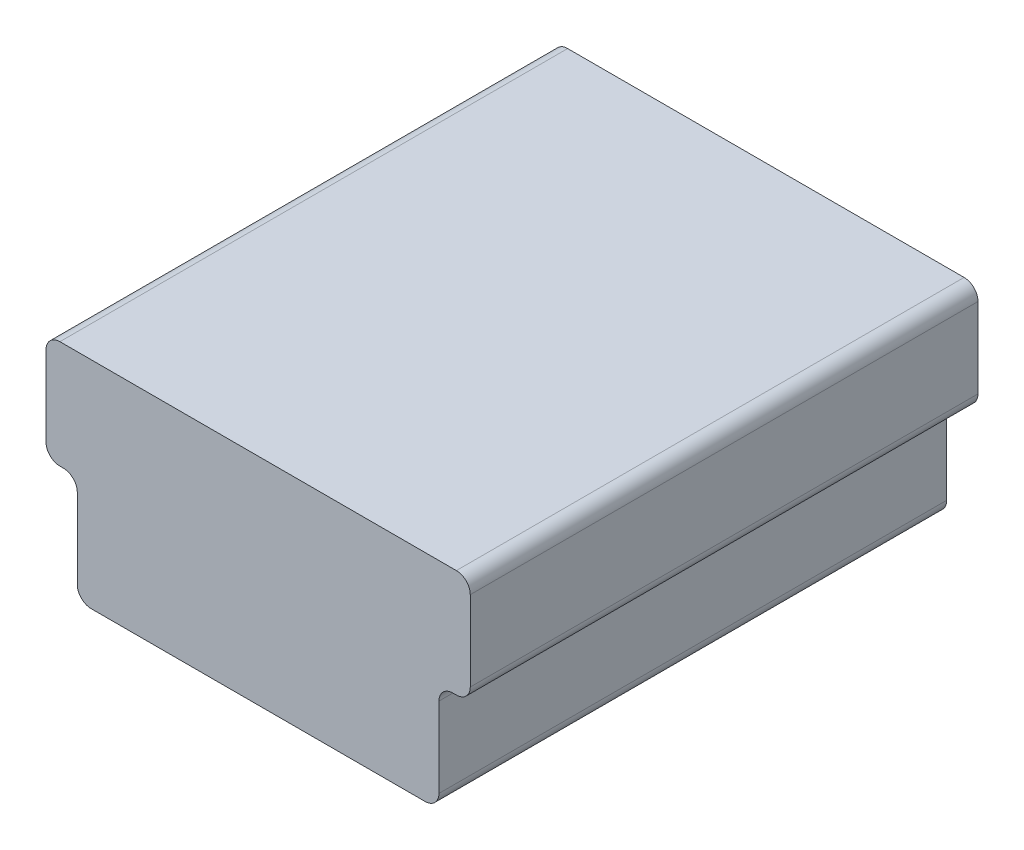
ISO-10303-21;
HEADER;
FILE_DESCRIPTION(('STEP AP214'),'2;1');
FILE_NAME('part.step','',(''),(''),'','','');
FILE_SCHEMA(('AUTOMOTIVE_DESIGN { 1 0 10303 214 1 1 1 1 }'));
ENDSEC;
DATA;
#1=APPLICATION_CONTEXT('core data for automotive mechanical design processes');
#2=APPLICATION_PROTOCOL_DEFINITION('international standard','automotive_design',2000,#1);
#3=PRODUCT_CONTEXT('',#1,'mechanical');
#4=PRODUCT('Part','Part','',(#3));
#5=PRODUCT_RELATED_PRODUCT_CATEGORY('part','',(#4));
#6=PRODUCT_DEFINITION_FORMATION('','',#4);
#7=PRODUCT_DEFINITION_CONTEXT('part definition',#1,'design');
#8=PRODUCT_DEFINITION('design','',#6,#7);
#9=PRODUCT_DEFINITION_SHAPE('','',#8);
#10=(LENGTH_UNIT() NAMED_UNIT(*) SI_UNIT(.MILLI.,.METRE.));
#11=(NAMED_UNIT(*) PLANE_ANGLE_UNIT() SI_UNIT($,.RADIAN.));
#12=(NAMED_UNIT(*) SI_UNIT($,.STERADIAN.) SOLID_ANGLE_UNIT());
#13=UNCERTAINTY_MEASURE_WITH_UNIT(LENGTH_MEASURE(1.E-05),#10,'distance_accuracy_value','');
#14=(GEOMETRIC_REPRESENTATION_CONTEXT(3) GLOBAL_UNCERTAINTY_ASSIGNED_CONTEXT((#13)) GLOBAL_UNIT_ASSIGNED_CONTEXT((#10,
#11,#12)) REPRESENTATION_CONTEXT('',''));
#15=CARTESIAN_POINT('',(0.,0.,0.));
#16=DIRECTION('',(0.,0.,1.));
#17=DIRECTION('',(1.,0.,0.));
#18=AXIS2_PLACEMENT_3D('',#15,#16,#17);
#19=CARTESIAN_POINT('',(3.556,1.9685,0.));
#20=DIRECTION('',(0.,1.,0.));
#21=DIRECTION('',(0.,0.,1.));
#22=AXIS2_PLACEMENT_3D('',#19,#20,#21);
#23=PLANE('',#22);
#24=DIRECTION('',(-1.,0.,0.));
#25=VECTOR('',#24,1.);
#26=CARTESIAN_POINT('',(3.58775,1.9685,0.));
#27=LINE('',#26,#25);
#28=CARTESIAN_POINT('',(3.61950000004886,1.9685,0.));
#29=VERTEX_POINT('',#28);
#30=CARTESIAN_POINT('',(3.55600000002605,1.9685,0.));
#31=VERTEX_POINT('',#30);
#32=EDGE_CURVE('E255',#29,#31,#27,.T.);
#33=ORIENTED_EDGE('',*,*,#32,.F.);
#34=DIRECTION('',(0.,0.,-1.));
#35=VECTOR('',#34,1.);
#36=CARTESIAN_POINT('',(3.61950000009771,1.9685,4.6355));
#37=LINE('',#36,#35);
#38=CARTESIAN_POINT('',(3.61950000004886,1.9685,9.271));
#39=VERTEX_POINT('',#38);
#40=EDGE_CURVE('E266',#29,#39,#37,.F.);
#41=ORIENTED_EDGE('',*,*,#40,.T.);
#42=DIRECTION('',(1.,0.,0.));
#43=VECTOR('',#42,1.);
#44=CARTESIAN_POINT('',(3.58775,1.9685,9.271));
#45=LINE('',#44,#43);
#46=CARTESIAN_POINT('',(3.55600000002605,1.9685,9.271));
#47=VERTEX_POINT('',#46);
#48=EDGE_CURVE('E261',#47,#39,#45,.T.);
#49=ORIENTED_EDGE('',*,*,#48,.F.);
#50=DIRECTION('',(0.,0.,-1.));
#51=VECTOR('',#50,1.);
#52=CARTESIAN_POINT('',(3.5560000000521,1.9685,4.6355));
#53=LINE('',#52,#51);
#54=EDGE_CURVE('E257',#31,#47,#53,.F.);
#55=ORIENTED_EDGE('',*,*,#54,.F.);
#56=EDGE_LOOP('',(#33,#41,#49,#55));
#57=FACE_BOUND('',#56,.T.);
#58=ADVANCED_FACE('F15',(#57),#23,.F.);
#59=CARTESIAN_POINT('',(-3.6195,1.9685,0.));
#60=DIRECTION('',(0.,1.,0.));
#61=DIRECTION('',(0.,0.,1.));
#62=AXIS2_PLACEMENT_3D('',#59,#60,#61);
#63=PLANE('',#62);
#64=DIRECTION('',(-1.,0.,0.));
#65=VECTOR('',#64,1.);
#66=CARTESIAN_POINT('',(-3.58775,1.9685,0.));
#67=LINE('',#66,#65);
#68=CARTESIAN_POINT('',(-3.55599999997395,1.9685,0.));
#69=VERTEX_POINT('',#68);
#70=CARTESIAN_POINT('',(-3.61949999995115,1.9685,0.));
#71=VERTEX_POINT('',#70);
#72=EDGE_CURVE('E220',#69,#71,#67,.T.);
#73=ORIENTED_EDGE('',*,*,#72,.F.);
#74=DIRECTION('',(0.,0.,1.));
#75=VECTOR('',#74,1.);
#76=CARTESIAN_POINT('',(-3.5559999999479,1.9685,4.6355));
#77=LINE('',#76,#75);
#78=CARTESIAN_POINT('',(-3.55599999997395,1.9685,9.271));
#79=VERTEX_POINT('',#78);
#80=EDGE_CURVE('E249',#79,#69,#77,.F.);
#81=ORIENTED_EDGE('',*,*,#80,.F.);
#82=DIRECTION('',(1.,0.,0.));
#83=VECTOR('',#82,1.);
#84=CARTESIAN_POINT('',(-3.58775,1.9685,9.271));
#85=LINE('',#84,#83);
#86=CARTESIAN_POINT('',(-3.61949999995115,1.9685,9.271));
#87=VERTEX_POINT('',#86);
#88=EDGE_CURVE('E253',#87,#79,#85,.T.);
#89=ORIENTED_EDGE('',*,*,#88,.F.);
#90=DIRECTION('',(0.,0.,1.));
#91=VECTOR('',#90,1.);
#92=CARTESIAN_POINT('',(-3.61949999990229,1.9685,4.6355));
#93=LINE('',#92,#91);
#94=EDGE_CURVE('E217',#87,#71,#93,.F.);
#95=ORIENTED_EDGE('',*,*,#94,.T.);
#96=EDGE_LOOP('',(#73,#81,#89,#95));
#97=FACE_BOUND('',#96,.T.);
#98=ADVANCED_FACE('F349',(#97),#63,.F.);
#99=CARTESIAN_POINT('',(-3.6195,2.2225,9.271));
#100=DIRECTION('',(0.,0.,-1.));
#101=DIRECTION('',(-1.,0.,0.));
#102=AXIS2_PLACEMENT_3D('',#99,#100,#101);
#103=CYLINDRICAL_SURFACE('',#102,0.254);
#104=CARTESIAN_POINT('',(-3.6195,2.2225,0.));
#105=DIRECTION('',(0.,0.,-1.));
#106=DIRECTION('',(-1.,0.,0.));
#107=AXIS2_PLACEMENT_3D('',#104,#105,#106);
#108=CIRCLE('',#107,0.254);
#109=CARTESIAN_POINT('',(-3.8735,2.2225,0.));
#110=VERTEX_POINT('',#109);
#111=EDGE_CURVE('E271',#71,#110,#108,.T.);
#112=ORIENTED_EDGE('',*,*,#111,.F.);
#113=ORIENTED_EDGE('',*,*,#94,.F.);
#114=CARTESIAN_POINT('',(-3.6195,2.2225,9.271));
#115=DIRECTION('',(0.,0.,-1.));
#116=DIRECTION('',(-1.,0.,0.));
#117=AXIS2_PLACEMENT_3D('',#114,#115,#116);
#118=CIRCLE('',#117,0.254);
#119=CARTESIAN_POINT('',(-3.8735,2.2225,9.271));
#120=VERTEX_POINT('',#119);
#121=EDGE_CURVE('E19',#120,#87,#118,.F.);
#122=ORIENTED_EDGE('',*,*,#121,.F.);
#123=DIRECTION('',(0.,0.,-1.));
#124=VECTOR('',#123,1.);
#125=CARTESIAN_POINT('',(-3.8735,2.2225,4.6355));
#126=LINE('',#125,#124);
#127=EDGE_CURVE('E215',#120,#110,#126,.T.);
#128=ORIENTED_EDGE('',*,*,#127,.T.);
#129=EDGE_LOOP('',(#112,#113,#122,#128));
#130=FACE_BOUND('',#129,.T.);
#131=ADVANCED_FACE('F214',(#130),#103,.T.);
#132=CARTESIAN_POINT('',(3.6195,2.2225,9.271));
#133=DIRECTION('',(0.,0.,-1.));
#134=DIRECTION('',(-1.,0.,0.));
#135=AXIS2_PLACEMENT_3D('',#132,#133,#134);
#136=CYLINDRICAL_SURFACE('',#135,0.254);
#137=CARTESIAN_POINT('',(3.6195,2.2225,0.));
#138=DIRECTION('',(0.,0.,-1.));
#139=DIRECTION('',(-1.,0.,0.));
#140=AXIS2_PLACEMENT_3D('',#137,#138,#139);
#141=CIRCLE('',#140,0.254);
#142=CARTESIAN_POINT('',(3.8735,2.2225,0.));
#143=VERTEX_POINT('',#142);
#144=EDGE_CURVE('E269',#143,#29,#141,.T.);
#145=ORIENTED_EDGE('',*,*,#144,.F.);
#146=DIRECTION('',(0.,0.,1.));
#147=VECTOR('',#146,1.);
#148=CARTESIAN_POINT('',(3.8735,2.2225,4.6355));
#149=LINE('',#148,#147);
#150=CARTESIAN_POINT('',(3.8735,2.2225,9.271));
#151=VERTEX_POINT('',#150);
#152=EDGE_CURVE('E245',#143,#151,#149,.T.);
#153=ORIENTED_EDGE('',*,*,#152,.T.);
#154=CARTESIAN_POINT('',(3.6195,2.2225,9.271));
#155=DIRECTION('',(0.,0.,-1.));
#156=DIRECTION('',(-1.,0.,0.));
#157=AXIS2_PLACEMENT_3D('',#154,#155,#156);
#158=CIRCLE('',#157,0.254);
#159=EDGE_CURVE('E340',#39,#151,#158,.F.);
#160=ORIENTED_EDGE('',*,*,#159,.F.);
#161=ORIENTED_EDGE('',*,*,#40,.F.);
#162=EDGE_LOOP('',(#145,#153,#160,#161));
#163=FACE_BOUND('',#162,.T.);
#164=ADVANCED_FACE('F799',(#163),#136,.T.);
#165=CARTESIAN_POINT('',(3.556,1.7145,9.271));
#166=DIRECTION('',(0.,0.,-1.));
#167=DIRECTION('',(-1.,0.,0.));
#168=AXIS2_PLACEMENT_3D('',#165,#166,#167);
#169=CYLINDRICAL_SURFACE('',#168,0.254);
#170=ORIENTED_EDGE('',*,*,#54,.T.);
#171=CARTESIAN_POINT('',(3.556,1.7145,9.271));
#172=DIRECTION('',(0.,0.,-1.));
#173=DIRECTION('',(-1.,0.,0.));
#174=AXIS2_PLACEMENT_3D('',#171,#172,#173);
#175=CIRCLE('',#174,0.254);
#176=CARTESIAN_POINT('',(3.301999999238,1.7145,9.271));
#177=VERTEX_POINT('',#176);
#178=EDGE_CURVE('E252',#47,#177,#175,.F.);
#179=ORIENTED_EDGE('',*,*,#178,.T.);
#180=DIRECTION('',(0.,0.,-1.));
#181=VECTOR('',#180,1.);
#182=CARTESIAN_POINT('',(3.302,1.7145,4.6355));
#183=LINE('',#182,#181);
#184=CARTESIAN_POINT('',(3.302,1.7145,0.));
#185=VERTEX_POINT('',#184);
#186=EDGE_CURVE('E247',#177,#185,#183,.T.);
#187=ORIENTED_EDGE('',*,*,#186,.T.);
#188=CARTESIAN_POINT('',(3.556,1.7145,0.));
#189=DIRECTION('',(0.,0.,-1.));
#190=DIRECTION('',(-1.,0.,0.));
#191=AXIS2_PLACEMENT_3D('',#188,#189,#190);
#192=CIRCLE('',#191,0.254);
#193=EDGE_CURVE('E260',#185,#31,#192,.T.);
#194=ORIENTED_EDGE('',*,*,#193,.T.);
#195=EDGE_LOOP('',(#170,#179,#187,#194));
#196=FACE_BOUND('',#195,.T.);
#197=ADVANCED_FACE('F792',(#196),#169,.F.);
#198=CARTESIAN_POINT('',(-3.556,1.7145,9.271));
#199=DIRECTION('',(0.,0.,-1.));
#200=DIRECTION('',(-1.,0.,0.));
#201=AXIS2_PLACEMENT_3D('',#198,#199,#200);
#202=CYLINDRICAL_SURFACE('',#201,0.254);
#203=DIRECTION('',(0.,0.,1.));
#204=VECTOR('',#203,1.);
#205=CARTESIAN_POINT('',(-3.302,1.7145,4.6355));
#206=LINE('',#205,#204);
#207=CARTESIAN_POINT('',(-3.302,1.7145,0.));
#208=VERTEX_POINT('',#207);
#209=CARTESIAN_POINT('',(-3.301999999238,1.7145,9.271));
#210=VERTEX_POINT('',#209);
#211=EDGE_CURVE('E355',#208,#210,#206,.T.);
#212=ORIENTED_EDGE('',*,*,#211,.T.);
#213=CARTESIAN_POINT('',(-3.556,1.7145,9.271));
#214=DIRECTION('',(0.,0.,-1.));
#215=DIRECTION('',(-1.,0.,0.));
#216=AXIS2_PLACEMENT_3D('',#213,#214,#215);
#217=CIRCLE('',#216,0.254);
#218=EDGE_CURVE('E234',#210,#79,#217,.F.);
#219=ORIENTED_EDGE('',*,*,#218,.T.);
#220=ORIENTED_EDGE('',*,*,#80,.T.);
#221=CARTESIAN_POINT('',(-3.556,1.7145,0.));
#222=DIRECTION('',(0.,0.,-1.));
#223=DIRECTION('',(-1.,0.,0.));
#224=AXIS2_PLACEMENT_3D('',#221,#222,#223);
#225=CIRCLE('',#224,0.254);
#226=EDGE_CURVE('E237',#69,#208,#225,.T.);
#227=ORIENTED_EDGE('',*,*,#226,.T.);
#228=EDGE_LOOP('',(#212,#219,#220,#227));
#229=FACE_BOUND('',#228,.T.);
#230=ADVANCED_FACE('F353',(#229),#202,.F.);
#231=CARTESIAN_POINT('',(-3.8735,2.2225,9.271));
#232=DIRECTION('',(1.,0.,0.));
#233=DIRECTION('',(0.,0.,-1.));
#234=AXIS2_PLACEMENT_3D('',#231,#232,#233);
#235=PLANE('',#234);
#236=DIRECTION('',(0.,1.,0.));
#237=VECTOR('',#236,1.);
#238=CARTESIAN_POINT('',(-3.8735,2.95275,0.));
#239=LINE('',#238,#237);
#240=CARTESIAN_POINT('',(-3.8735,3.683,0.));
#241=VERTEX_POINT('',#240);
#242=EDGE_CURVE('E227',#110,#241,#239,.T.);
#243=ORIENTED_EDGE('',*,*,#242,.F.);
#244=ORIENTED_EDGE('',*,*,#127,.F.);
#245=DIRECTION('',(0.,-1.,0.));
#246=VECTOR('',#245,1.);
#247=CARTESIAN_POINT('',(-3.8735,2.95275,9.271));
#248=LINE('',#247,#246);
#249=CARTESIAN_POINT('',(-3.8735,3.683,9.271));
#250=VERTEX_POINT('',#249);
#251=EDGE_CURVE('E225',#250,#120,#248,.T.);
#252=ORIENTED_EDGE('',*,*,#251,.F.);
#253=DIRECTION('',(0.,0.,1.));
#254=VECTOR('',#253,1.);
#255=CARTESIAN_POINT('',(-3.8735,3.683,4.6355));
#256=LINE('',#255,#254);
#257=EDGE_CURVE('E333',#250,#241,#256,.F.);
#258=ORIENTED_EDGE('',*,*,#257,.T.);
#259=EDGE_LOOP('',(#243,#244,#252,#258));
#260=FACE_BOUND('',#259,.T.);
#261=ADVANCED_FACE('F223',(#260),#235,.F.);
#262=CARTESIAN_POINT('',(3.8735,2.2225,0.));
#263=DIRECTION('',(-1.,0.,0.));
#264=DIRECTION('',(0.,0.,1.));
#265=AXIS2_PLACEMENT_3D('',#262,#263,#264);
#266=PLANE('',#265);
#267=DIRECTION('',(0.,-1.,0.));
#268=VECTOR('',#267,1.);
#269=CARTESIAN_POINT('',(3.8735,2.95275,0.));
#270=LINE('',#269,#268);
#271=CARTESIAN_POINT('',(3.8735,3.6829999999479,0.));
#272=VERTEX_POINT('',#271);
#273=EDGE_CURVE('E241',#272,#143,#270,.T.);
#274=ORIENTED_EDGE('',*,*,#273,.F.);
#275=DIRECTION('',(0.,0.,-1.));
#276=VECTOR('',#275,1.);
#277=CARTESIAN_POINT('',(3.8735,3.68299999989581,4.6355));
#278=LINE('',#277,#276);
#279=CARTESIAN_POINT('',(3.8735,3.6829999999479,9.271));
#280=VERTEX_POINT('',#279);
#281=EDGE_CURVE('E331',#272,#280,#278,.F.);
#282=ORIENTED_EDGE('',*,*,#281,.T.);
#283=DIRECTION('',(0.,1.,0.));
#284=VECTOR('',#283,1.);
#285=CARTESIAN_POINT('',(3.8735,2.95275,9.271));
#286=LINE('',#285,#284);
#287=EDGE_CURVE('E244',#151,#280,#286,.T.);
#288=ORIENTED_EDGE('',*,*,#287,.F.);
#289=ORIENTED_EDGE('',*,*,#152,.F.);
#290=EDGE_LOOP('',(#274,#282,#288,#289));
#291=FACE_BOUND('',#290,.T.);
#292=ADVANCED_FACE('F389',(#291),#266,.F.);
#293=CARTESIAN_POINT('',(3.302,1.7145,0.));
#294=DIRECTION('',(-1.,0.,0.));
#295=DIRECTION('',(0.,-1.,0.));
#296=AXIS2_PLACEMENT_3D('',#293,#294,#295);
#297=PLANE('',#296);
#298=DIRECTION('',(0.,-1.,0.));
#299=VECTOR('',#298,1.);
#300=CARTESIAN_POINT('',(3.302,0.98425,0.));
#301=LINE('',#300,#299);
#302=CARTESIAN_POINT('',(3.302,0.253999999947904,0.));
#303=VERTEX_POINT('',#302);
#304=EDGE_CURVE('E376',#185,#303,#301,.T.);
#305=ORIENTED_EDGE('',*,*,#304,.F.);
#306=ORIENTED_EDGE('',*,*,#186,.F.);
#307=DIRECTION('',(0.,1.,0.));
#308=VECTOR('',#307,1.);
#309=CARTESIAN_POINT('',(3.301999998476,1.9685,9.271));
#310=LINE('',#309,#308);
#311=CARTESIAN_POINT('',(3.301999999238,0.253999999947904,9.271));
#312=VERTEX_POINT('',#311);
#313=EDGE_CURVE('E327',#312,#177,#310,.T.);
#314=ORIENTED_EDGE('',*,*,#313,.F.);
#315=DIRECTION('',(0.,0.,1.));
#316=VECTOR('',#315,1.);
#317=CARTESIAN_POINT('',(3.302,0.253999999895808,4.6355));
#318=LINE('',#317,#316);
#319=EDGE_CURVE('E319',#312,#303,#318,.F.);
#320=ORIENTED_EDGE('',*,*,#319,.T.);
#321=EDGE_LOOP('',(#305,#306,#314,#320));
#322=FACE_BOUND('',#321,.T.);
#323=ADVANCED_FACE('F766',(#322),#297,.F.);
#324=CARTESIAN_POINT('',(-3.302,0.254,0.));
#325=DIRECTION('',(1.,0.,0.));
#326=DIRECTION('',(0.,1.,0.));
#327=AXIS2_PLACEMENT_3D('',#324,#325,#326);
#328=PLANE('',#327);
#329=DIRECTION('',(0.,1.,0.));
#330=VECTOR('',#329,1.);
#331=CARTESIAN_POINT('',(-3.302,0.98425,0.));
#332=LINE('',#331,#330);
#333=CARTESIAN_POINT('',(-3.302,0.253999999977193,0.));
#334=VERTEX_POINT('',#333);
#335=EDGE_CURVE('E359',#334,#208,#332,.T.);
#336=ORIENTED_EDGE('',*,*,#335,.F.);
#337=DIRECTION('',(0.,0.,-1.));
#338=VECTOR('',#337,1.);
#339=CARTESIAN_POINT('',(-3.302,0.253999999954385,4.6355));
#340=LINE('',#339,#338);
#341=CARTESIAN_POINT('',(-3.301999999238,0.253999999977193,9.271));
#342=VERTEX_POINT('',#341);
#343=EDGE_CURVE('E311',#334,#342,#340,.F.);
#344=ORIENTED_EDGE('',*,*,#343,.T.);
#345=DIRECTION('',(0.,-1.,0.));
#346=VECTOR('',#345,1.);
#347=CARTESIAN_POINT('',(-3.301999998476,1.9685,9.271));
#348=LINE('',#347,#346);
#349=EDGE_CURVE('E323',#210,#342,#348,.T.);
#350=ORIENTED_EDGE('',*,*,#349,.F.);
#351=ORIENTED_EDGE('',*,*,#211,.F.);
#352=EDGE_LOOP('',(#336,#344,#350,#351));
#353=FACE_BOUND('',#352,.T.);
#354=ADVANCED_FACE('F362',(#353),#328,.F.);
#355=CARTESIAN_POINT('',(-3.6195,3.683,9.271));
#356=DIRECTION('',(0.,0.,-1.));
#357=DIRECTION('',(-1.,0.,0.));
#358=AXIS2_PLACEMENT_3D('',#355,#356,#357);
#359=CYLINDRICAL_SURFACE('',#358,0.254);
#360=CARTESIAN_POINT('',(-3.6195,3.683,0.));
#361=DIRECTION('',(0.,0.,-1.));
#362=DIRECTION('',(-1.,0.,0.));
#363=AXIS2_PLACEMENT_3D('',#360,#361,#362);
#364=CIRCLE('',#363,0.254);
#365=CARTESIAN_POINT('',(-3.6195,3.937,0.));
#366=VERTEX_POINT('',#365);
#367=EDGE_CURVE('E332',#241,#366,#364,.T.);
#368=ORIENTED_EDGE('',*,*,#367,.F.);
#369=ORIENTED_EDGE('',*,*,#257,.F.);
#370=CARTESIAN_POINT('',(-3.6195,3.683,9.271));
#371=DIRECTION('',(0.,0.,-1.));
#372=DIRECTION('',(-1.,0.,0.));
#373=AXIS2_PLACEMENT_3D('',#370,#371,#372);
#374=CIRCLE('',#373,0.254);
#375=CARTESIAN_POINT('',(-3.6195,3.937,9.271));
#376=VERTEX_POINT('',#375);
#377=EDGE_CURVE('E233',#376,#250,#374,.F.);
#378=ORIENTED_EDGE('',*,*,#377,.F.);
#379=DIRECTION('',(0.,0.,-1.));
#380=VECTOR('',#379,1.);
#381=CARTESIAN_POINT('',(-3.6195,3.937,4.6355));
#382=LINE('',#381,#380);
#383=EDGE_CURVE('E373',#376,#366,#382,.T.);
#384=ORIENTED_EDGE('',*,*,#383,.T.);
#385=EDGE_LOOP('',(#368,#369,#378,#384));
#386=FACE_BOUND('',#385,.T.);
#387=ADVANCED_FACE('F754',(#386),#359,.T.);
#388=CARTESIAN_POINT('',(3.6195,3.683,9.271));
#389=DIRECTION('',(0.,0.,-1.));
#390=DIRECTION('',(-1.,0.,0.));
#391=AXIS2_PLACEMENT_3D('',#388,#389,#390);
#392=CYLINDRICAL_SURFACE('',#391,0.254);
#393=CARTESIAN_POINT('',(3.6195,3.683,0.));
#394=DIRECTION('',(0.,0.,-1.));
#395=DIRECTION('',(-1.,0.,0.));
#396=AXIS2_PLACEMENT_3D('',#393,#394,#395);
#397=CIRCLE('',#396,0.254);
#398=CARTESIAN_POINT('',(3.6195,3.937,0.));
#399=VERTEX_POINT('',#398);
#400=EDGE_CURVE('E328',#399,#272,#397,.T.);
#401=ORIENTED_EDGE('',*,*,#400,.F.);
#402=DIRECTION('',(0.,0.,1.));
#403=VECTOR('',#402,1.);
#404=CARTESIAN_POINT('',(3.6195,3.937,4.6355));
#405=LINE('',#404,#403);
#406=CARTESIAN_POINT('',(3.6195,3.937,9.271));
#407=VERTEX_POINT('',#406);
#408=EDGE_CURVE('E395',#399,#407,#405,.T.);
#409=ORIENTED_EDGE('',*,*,#408,.T.);
#410=CARTESIAN_POINT('',(3.6195,3.683,9.271));
#411=DIRECTION('',(0.,0.,-1.));
#412=DIRECTION('',(-1.,0.,0.));
#413=AXIS2_PLACEMENT_3D('',#410,#411,#412);
#414=CIRCLE('',#413,0.254);
#415=EDGE_CURVE('E325',#280,#407,#414,.F.);
#416=ORIENTED_EDGE('',*,*,#415,.F.);
#417=ORIENTED_EDGE('',*,*,#281,.F.);
#418=EDGE_LOOP('',(#401,#409,#416,#417));
#419=FACE_BOUND('',#418,.T.);
#420=ADVANCED_FACE('F392',(#419),#392,.T.);
#421=CARTESIAN_POINT('',(-3.8735,0.,9.271));
#422=DIRECTION('',(0.,0.,1.));
#423=DIRECTION('',(1.,0.,0.));
#424=AXIS2_PLACEMENT_3D('',#421,#422,#423);
#425=PLANE('',#424);
#426=CARTESIAN_POINT('',(-3.048,0.254,9.271));
#427=DIRECTION('',(0.,0.,-1.));
#428=DIRECTION('',(-1.,0.,0.));
#429=AXIS2_PLACEMENT_3D('',#426,#427,#428);
#430=CIRCLE('',#429,0.254);
#431=CARTESIAN_POINT('',(-3.048,0.,9.271));
#432=VERTEX_POINT('',#431);
#433=EDGE_CURVE('E315',#342,#432,#430,.F.);
#434=ORIENTED_EDGE('',*,*,#433,.T.);
#435=DIRECTION('',(1.,0.,0.));
#436=VECTOR('',#435,1.);
#437=CARTESIAN_POINT('',(0.,0.,9.271));
#438=LINE('',#437,#436);
#439=CARTESIAN_POINT('',(3.048,0.,9.271));
#440=VERTEX_POINT('',#439);
#441=EDGE_CURVE('E368',#432,#440,#438,.T.);
#442=ORIENTED_EDGE('',*,*,#441,.T.);
#443=CARTESIAN_POINT('',(3.048,0.254,9.271));
#444=DIRECTION('',(0.,0.,-1.));
#445=DIRECTION('',(-1.,0.,0.));
#446=AXIS2_PLACEMENT_3D('',#443,#444,#445);
#447=CIRCLE('',#446,0.254);
#448=EDGE_CURVE('E320',#440,#312,#447,.F.);
#449=ORIENTED_EDGE('',*,*,#448,.T.);
#450=ORIENTED_EDGE('',*,*,#313,.T.);
#451=ORIENTED_EDGE('',*,*,#178,.F.);
#452=ORIENTED_EDGE('',*,*,#48,.T.);
#453=ORIENTED_EDGE('',*,*,#159,.T.);
#454=ORIENTED_EDGE('',*,*,#287,.T.);
#455=ORIENTED_EDGE('',*,*,#415,.T.);
#456=DIRECTION('',(-1.,0.,0.));
#457=VECTOR('',#456,1.);
#458=CARTESIAN_POINT('',(0.,3.937,9.271));
#459=LINE('',#458,#457);
#460=EDGE_CURVE('E303',#407,#376,#459,.T.);
#461=ORIENTED_EDGE('',*,*,#460,.T.);
#462=ORIENTED_EDGE('',*,*,#377,.T.);
#463=ORIENTED_EDGE('',*,*,#251,.T.);
#464=ORIENTED_EDGE('',*,*,#121,.T.);
#465=ORIENTED_EDGE('',*,*,#88,.T.);
#466=ORIENTED_EDGE('',*,*,#218,.F.);
#467=ORIENTED_EDGE('',*,*,#349,.T.);
#468=EDGE_LOOP('',(#434,#442,#449,#450,#451,#452,#453,#454,#455,#461,#462,#463,#464,#465,#466,#467));
#469=FACE_BOUND('',#468,.T.);
#470=ADVANCED_FACE('F231',(#469),#425,.T.);
#471=CARTESIAN_POINT('',(3.048,0.254,9.271));
#472=DIRECTION('',(0.,0.,-1.));
#473=DIRECTION('',(-1.,0.,0.));
#474=AXIS2_PLACEMENT_3D('',#471,#472,#473);
#475=CYLINDRICAL_SURFACE('',#474,0.254);
#476=CARTESIAN_POINT('',(3.048,0.254,0.));
#477=DIRECTION('',(0.,0.,-1.));
#478=DIRECTION('',(-1.,0.,0.));
#479=AXIS2_PLACEMENT_3D('',#476,#477,#478);
#480=CIRCLE('',#479,0.254);
#481=CARTESIAN_POINT('',(3.048,0.,0.));
#482=VERTEX_POINT('',#481);
#483=EDGE_CURVE('E317',#303,#482,#480,.T.);
#484=ORIENTED_EDGE('',*,*,#483,.F.);
#485=ORIENTED_EDGE('',*,*,#319,.F.);
#486=ORIENTED_EDGE('',*,*,#448,.F.);
#487=DIRECTION('',(0.,0.,-1.));
#488=VECTOR('',#487,1.);
#489=CARTESIAN_POINT('',(3.048,0.,4.6355));
#490=LINE('',#489,#488);
#491=EDGE_CURVE('E447',#440,#482,#490,.T.);
#492=ORIENTED_EDGE('',*,*,#491,.T.);
#493=EDGE_LOOP('',(#484,#485,#486,#492));
#494=FACE_BOUND('',#493,.T.);
#495=ADVANCED_FACE('F667',(#494),#475,.T.);
#496=CARTESIAN_POINT('',(-3.048,0.254,9.271));
#497=DIRECTION('',(0.,0.,-1.));
#498=DIRECTION('',(-1.,0.,0.));
#499=AXIS2_PLACEMENT_3D('',#496,#497,#498);
#500=CYLINDRICAL_SURFACE('',#499,0.254);
#501=CARTESIAN_POINT('',(-3.048,0.254,0.));
#502=DIRECTION('',(0.,0.,-1.));
#503=DIRECTION('',(-1.,0.,0.));
#504=AXIS2_PLACEMENT_3D('',#501,#502,#503);
#505=CIRCLE('',#504,0.254);
#506=CARTESIAN_POINT('',(-3.048,0.,0.));
#507=VERTEX_POINT('',#506);
#508=EDGE_CURVE('E312',#507,#334,#505,.T.);
#509=ORIENTED_EDGE('',*,*,#508,.F.);
#510=DIRECTION('',(0.,0.,1.));
#511=VECTOR('',#510,1.);
#512=CARTESIAN_POINT('',(-3.048,0.,4.6355));
#513=LINE('',#512,#511);
#514=EDGE_CURVE('E442',#507,#432,#513,.T.);
#515=ORIENTED_EDGE('',*,*,#514,.T.);
#516=ORIENTED_EDGE('',*,*,#433,.F.);
#517=ORIENTED_EDGE('',*,*,#343,.F.);
#518=EDGE_LOOP('',(#509,#515,#516,#517));
#519=FACE_BOUND('',#518,.T.);
#520=ADVANCED_FACE('F734',(#519),#500,.T.);
#521=CARTESIAN_POINT('',(3.556,1.7145,8.89));
#522=DIRECTION('',(0.,0.,-1.));
#523=DIRECTION('',(-1.,0.,0.));
#524=AXIS2_PLACEMENT_3D('',#521,#522,#523);
#525=CYLINDRICAL_SURFACE('',#524,0.635);
#526=CARTESIAN_POINT('',(3.556,1.7145,8.89));
#527=DIRECTION('',(0.,0.,-1.));
#528=DIRECTION('',(-1.,0.,0.));
#529=AXIS2_PLACEMENT_3D('',#526,#527,#528);
#530=CIRCLE('',#529,0.635);
#531=CARTESIAN_POINT('',(3.4925,2.34631702348135,8.89));
#532=VERTEX_POINT('',#531);
#533=CARTESIAN_POINT('',(2.921,1.7145,8.89));
#534=VERTEX_POINT('',#533);
#535=EDGE_CURVE('E306',#532,#534,#530,.F.);
#536=ORIENTED_EDGE('',*,*,#535,.F.);
#537=DIRECTION('',(0.,0.,1.));
#538=VECTOR('',#537,1.);
#539=CARTESIAN_POINT('',(3.4925,2.3463170244,4.445));
#540=LINE('',#539,#538);
#541=CARTESIAN_POINT('',(3.492499999492,2.3463170234303,0.));
#542=VERTEX_POINT('',#541);
#543=EDGE_CURVE('E421',#542,#532,#540,.T.);
#544=ORIENTED_EDGE('',*,*,#543,.F.);
#545=CARTESIAN_POINT('',(3.556,1.7145,0.));
#546=DIRECTION('',(0.,0.,-1.));
#547=DIRECTION('',(-1.,0.,0.));
#548=AXIS2_PLACEMENT_3D('',#545,#546,#547);
#549=CIRCLE('',#548,0.635);
#550=CARTESIAN_POINT('',(2.92099999873,1.7145,0.));
#551=VERTEX_POINT('',#550);
#552=EDGE_CURVE('E309',#551,#542,#549,.T.);
#553=ORIENTED_EDGE('',*,*,#552,.F.);
#554=DIRECTION('',(0.,0.,-1.));
#555=VECTOR('',#554,1.);
#556=CARTESIAN_POINT('',(2.921,1.7145,4.445));
#557=LINE('',#556,#555);
#558=EDGE_CURVE('E426',#534,#551,#557,.T.);
#559=ORIENTED_EDGE('',*,*,#558,.F.);
#560=EDGE_LOOP('',(#536,#544,#553,#559));
#561=FACE_BOUND('',#560,.T.);
#562=ADVANCED_FACE('F726',(#561),#525,.T.);
#563=CARTESIAN_POINT('',(-3.556,1.7145,8.89));
#564=DIRECTION('',(0.,0.,-1.));
#565=DIRECTION('',(-1.,0.,0.));
#566=AXIS2_PLACEMENT_3D('',#563,#564,#565);
#567=CYLINDRICAL_SURFACE('',#566,0.635000000000001);
#568=CARTESIAN_POINT('',(-3.556,1.7145,8.89));
#569=DIRECTION('',(0.,0.,-1.));
#570=DIRECTION('',(-1.,0.,0.));
#571=AXIS2_PLACEMENT_3D('',#568,#569,#570);
#572=CIRCLE('',#571,0.635000000000001);
#573=CARTESIAN_POINT('',(-2.921,1.7145,8.89));
#574=VERTEX_POINT('',#573);
#575=CARTESIAN_POINT('',(-3.4925,2.34631702348135,8.89));
#576=VERTEX_POINT('',#575);
#577=EDGE_CURVE('E300',#574,#576,#572,.F.);
#578=ORIENTED_EDGE('',*,*,#577,.F.);
#579=DIRECTION('',(0.,0.,1.));
#580=VECTOR('',#579,1.);
#581=CARTESIAN_POINT('',(-2.921,1.7145,4.445));
#582=LINE('',#581,#580);
#583=CARTESIAN_POINT('',(-2.92099999873,1.7145,0.));
#584=VERTEX_POINT('',#583);
#585=EDGE_CURVE('E435',#584,#574,#582,.T.);
#586=ORIENTED_EDGE('',*,*,#585,.F.);
#587=CARTESIAN_POINT('',(-3.556,1.7145,0.));
#588=DIRECTION('',(0.,0.,-1.));
#589=DIRECTION('',(-1.,0.,0.));
#590=AXIS2_PLACEMENT_3D('',#587,#588,#589);
#591=CIRCLE('',#590,0.635000000000001);
#592=CARTESIAN_POINT('',(-3.492499999492,2.3463170234303,0.));
#593=VERTEX_POINT('',#592);
#594=EDGE_CURVE('E304',#593,#584,#591,.T.);
#595=ORIENTED_EDGE('',*,*,#594,.F.);
#596=DIRECTION('',(0.,0.,-1.));
#597=VECTOR('',#596,1.);
#598=CARTESIAN_POINT('',(-3.4925,2.3463170244,4.445));
#599=LINE('',#598,#597);
#600=EDGE_CURVE('E410',#576,#593,#599,.T.);
#601=ORIENTED_EDGE('',*,*,#600,.F.);
#602=EDGE_LOOP('',(#578,#586,#595,#601));
#603=FACE_BOUND('',#602,.T.);
#604=ADVANCED_FACE('F719',(#603),#567,.T.);
#605=CARTESIAN_POINT('',(-3.6195,3.937,9.271));
#606=DIRECTION('',(0.,-1.,0.));
#607=DIRECTION('',(0.,0.,-1.));
#608=AXIS2_PLACEMENT_3D('',#605,#606,#607);
#609=PLANE('',#608);
#610=DIRECTION('',(-1.,0.,0.));
#611=VECTOR('',#610,1.);
#612=CARTESIAN_POINT('',(0.,3.937,0.));
#613=LINE('',#612,#611);
#614=EDGE_CURVE('E402',#399,#366,#613,.T.);
#615=ORIENTED_EDGE('',*,*,#614,.T.);
#616=ORIENTED_EDGE('',*,*,#383,.F.);
#617=ORIENTED_EDGE('',*,*,#460,.F.);
#618=ORIENTED_EDGE('',*,*,#408,.F.);
#619=EDGE_LOOP('',(#615,#616,#617,#618));
#620=FACE_BOUND('',#619,.T.);
#621=ADVANCED_FACE('F400',(#620),#609,.F.);
#622=CARTESIAN_POINT('',(-3.048,0.,0.));
#623=DIRECTION('',(0.,1.,0.));
#624=DIRECTION('',(0.,0.,1.));
#625=AXIS2_PLACEMENT_3D('',#622,#623,#624);
#626=PLANE('',#625);
#627=DIRECTION('',(1.,0.,0.));
#628=VECTOR('',#627,1.);
#629=CARTESIAN_POINT('',(0.,0.,0.));
#630=LINE('',#629,#628);
#631=EDGE_CURVE('E491',#507,#482,#630,.T.);
#632=ORIENTED_EDGE('',*,*,#631,.T.);
#633=ORIENTED_EDGE('',*,*,#491,.F.);
#634=ORIENTED_EDGE('',*,*,#441,.F.);
#635=ORIENTED_EDGE('',*,*,#514,.F.);
#636=EDGE_LOOP('',(#632,#633,#634,#635));
#637=FACE_BOUND('',#636,.T.);
#638=ADVANCED_FACE('F490',(#637),#626,.F.);
#639=CARTESIAN_POINT('',(-2.921,0.381,8.89));
#640=DIRECTION('',(1.,0.,0.));
#641=DIRECTION('',(0.,0.,-1.));
#642=AXIS2_PLACEMENT_3D('',#639,#640,#641);
#643=PLANE('',#642);
#644=DIRECTION('',(0.,0.,1.));
#645=VECTOR('',#644,1.);
#646=CARTESIAN_POINT('',(-2.921,0.381,4.445));
#647=LINE('',#646,#645);
#648=CARTESIAN_POINT('',(-2.92099999746,0.381000001778,0.));
#649=VERTEX_POINT('',#648);
#650=CARTESIAN_POINT('',(-2.92099999989417,0.381,8.89));
#651=VERTEX_POINT('',#650);
#652=EDGE_CURVE('E292',#649,#651,#647,.T.);
#653=ORIENTED_EDGE('',*,*,#652,.F.);
#654=DIRECTION('',(0.,1.,0.));
#655=VECTOR('',#654,1.);
#656=CARTESIAN_POINT('',(-2.92099999746,1.9685,0.));
#657=LINE('',#656,#655);
#658=EDGE_CURVE('E508',#649,#584,#657,.T.);
#659=ORIENTED_EDGE('',*,*,#658,.T.);
#660=ORIENTED_EDGE('',*,*,#585,.T.);
#661=DIRECTION('',(0.,-1.,0.));
#662=VECTOR('',#661,1.);
#663=CARTESIAN_POINT('',(-2.921,1.04775,8.89));
#664=LINE('',#663,#662);
#665=EDGE_CURVE('E427',#574,#651,#664,.T.);
#666=ORIENTED_EDGE('',*,*,#665,.T.);
#667=EDGE_LOOP('',(#653,#659,#660,#666));
#668=FACE_BOUND('',#667,.T.);
#669=ADVANCED_FACE('F699',(#668),#643,.T.);
#670=CARTESIAN_POINT('',(2.921,0.381,0.));
#671=DIRECTION('',(-1.,0.,0.));
#672=DIRECTION('',(0.,0.,1.));
#673=AXIS2_PLACEMENT_3D('',#670,#671,#672);
#674=PLANE('',#673);
#675=ORIENTED_EDGE('',*,*,#558,.T.);
#676=DIRECTION('',(0.,-1.,0.));
#677=VECTOR('',#676,1.);
#678=CARTESIAN_POINT('',(2.92099999746,1.9685,0.));
#679=LINE('',#678,#677);
#680=CARTESIAN_POINT('',(2.9209999984125,0.381000000889,0.));
#681=VERTEX_POINT('',#680);
#682=EDGE_CURVE('E503',#551,#681,#679,.T.);
#683=ORIENTED_EDGE('',*,*,#682,.T.);
#684=DIRECTION('',(0.,0.,-1.));
#685=VECTOR('',#684,1.);
#686=CARTESIAN_POINT('',(2.921,0.381,4.445));
#687=LINE('',#686,#685);
#688=CARTESIAN_POINT('',(2.921,0.381,8.89));
#689=VERTEX_POINT('',#688);
#690=EDGE_CURVE('E456',#689,#681,#687,.T.);
#691=ORIENTED_EDGE('',*,*,#690,.F.);
#692=DIRECTION('',(0.,1.,0.));
#693=VECTOR('',#692,1.);
#694=CARTESIAN_POINT('',(2.921,1.04775,8.89));
#695=LINE('',#694,#693);
#696=EDGE_CURVE('E424',#689,#534,#695,.T.);
#697=ORIENTED_EDGE('',*,*,#696,.T.);
#698=EDGE_LOOP('',(#675,#683,#691,#697));
#699=FACE_BOUND('',#698,.T.);
#700=ADVANCED_FACE('F691',(#699),#674,.T.);
#701=CARTESIAN_POINT('',(3.4925,2.3463170244,0.));
#702=DIRECTION('',(-1.,0.,0.));
#703=DIRECTION('',(0.,0.,1.));
#704=AXIS2_PLACEMENT_3D('',#701,#702,#703);
#705=PLANE('',#704);
#706=DIRECTION('',(0.,0.,1.));
#707=VECTOR('',#706,1.);
#708=CARTESIAN_POINT('',(3.4925,3.556,4.445));
#709=LINE('',#708,#707);
#710=CARTESIAN_POINT('',(3.492499998984,3.555999998222,0.));
#711=VERTEX_POINT('',#710);
#712=CARTESIAN_POINT('',(3.4925,3.556,8.89));
#713=VERTEX_POINT('',#712);
#714=EDGE_CURVE('E455',#711,#713,#709,.T.);
#715=ORIENTED_EDGE('',*,*,#714,.F.);
#716=DIRECTION('',(0.,-1.,0.));
#717=VECTOR('',#716,1.);
#718=CARTESIAN_POINT('',(3.492499998984,1.9685,0.));
#719=LINE('',#718,#717);
#720=EDGE_CURVE('E494',#711,#542,#719,.T.);
#721=ORIENTED_EDGE('',*,*,#720,.T.);
#722=ORIENTED_EDGE('',*,*,#543,.T.);
#723=DIRECTION('',(0.,1.,0.));
#724=VECTOR('',#723,1.);
#725=CARTESIAN_POINT('',(3.4925,2.9511585122,8.89));
#726=LINE('',#725,#724);
#727=EDGE_CURVE('E411',#532,#713,#726,.T.);
#728=ORIENTED_EDGE('',*,*,#727,.T.);
#729=EDGE_LOOP('',(#715,#721,#722,#728));
#730=FACE_BOUND('',#729,.T.);
#731=ADVANCED_FACE('F684',(#730),#705,.T.);
#732=CARTESIAN_POINT('',(-3.4925,2.3463170244,8.89));
#733=DIRECTION('',(1.,0.,0.));
#734=DIRECTION('',(0.,0.,-1.));
#735=AXIS2_PLACEMENT_3D('',#732,#733,#734);
#736=PLANE('',#735);
#737=ORIENTED_EDGE('',*,*,#600,.T.);
#738=DIRECTION('',(0.,1.,0.));
#739=VECTOR('',#738,1.);
#740=CARTESIAN_POINT('',(-3.492499998984,1.9685,0.));
#741=LINE('',#740,#739);
#742=CARTESIAN_POINT('',(-3.492499999365,3.555999999111,0.));
#743=VERTEX_POINT('',#742);
#744=EDGE_CURVE('E492',#593,#743,#741,.T.);
#745=ORIENTED_EDGE('',*,*,#744,.T.);
#746=DIRECTION('',(0.,0.,-1.));
#747=VECTOR('',#746,1.);
#748=CARTESIAN_POINT('',(-3.4925,3.556,4.445));
#749=LINE('',#748,#747);
#750=CARTESIAN_POINT('',(-3.4925,3.556,8.89));
#751=VERTEX_POINT('',#750);
#752=EDGE_CURVE('E471',#751,#743,#749,.T.);
#753=ORIENTED_EDGE('',*,*,#752,.F.);
#754=DIRECTION('',(0.,-1.,0.));
#755=VECTOR('',#754,1.);
#756=CARTESIAN_POINT('',(-3.4925,2.9511585122,8.89));
#757=LINE('',#756,#755);
#758=EDGE_CURVE('E408',#751,#576,#757,.T.);
#759=ORIENTED_EDGE('',*,*,#758,.T.);
#760=EDGE_LOOP('',(#737,#745,#753,#759));
#761=FACE_BOUND('',#760,.T.);
#762=ADVANCED_FACE('F558',(#761),#736,.T.);
#763=CARTESIAN_POINT('',(-3.8735,0.,0.));
#764=DIRECTION('',(0.,0.,1.));
#765=DIRECTION('',(1.,0.,0.));
#766=AXIS2_PLACEMENT_3D('',#763,#764,#765);
#767=PLANE('',#766);
#768=ORIENTED_EDGE('',*,*,#658,.F.);
#769=DIRECTION('',(-1.,0.,0.));
#770=VECTOR('',#769,1.);
#771=CARTESIAN_POINT('',(0.,0.381,0.));
#772=LINE('',#771,#770);
#773=EDGE_CURVE('E452',#681,#649,#772,.T.);
#774=ORIENTED_EDGE('',*,*,#773,.F.);
#775=ORIENTED_EDGE('',*,*,#682,.F.);
#776=ORIENTED_EDGE('',*,*,#552,.T.);
#777=ORIENTED_EDGE('',*,*,#720,.F.);
#778=DIRECTION('',(1.,0.,0.));
#779=VECTOR('',#778,1.);
#780=CARTESIAN_POINT('',(0.,3.556,0.));
#781=LINE('',#780,#779);
#782=EDGE_CURVE('E288',#743,#711,#781,.T.);
#783=ORIENTED_EDGE('',*,*,#782,.F.);
#784=ORIENTED_EDGE('',*,*,#744,.F.);
#785=ORIENTED_EDGE('',*,*,#594,.T.);
#786=EDGE_LOOP('',(#768,#774,#775,#776,#777,#783,#784,#785));
#787=FACE_BOUND('',#786,.T.);
#788=ORIENTED_EDGE('',*,*,#631,.F.);
#789=ORIENTED_EDGE('',*,*,#508,.T.);
#790=ORIENTED_EDGE('',*,*,#335,.T.);
#791=ORIENTED_EDGE('',*,*,#226,.F.);
#792=ORIENTED_EDGE('',*,*,#72,.T.);
#793=ORIENTED_EDGE('',*,*,#111,.T.);
#794=ORIENTED_EDGE('',*,*,#242,.T.);
#795=ORIENTED_EDGE('',*,*,#367,.T.);
#796=ORIENTED_EDGE('',*,*,#614,.F.);
#797=ORIENTED_EDGE('',*,*,#400,.T.);
#798=ORIENTED_EDGE('',*,*,#273,.T.);
#799=ORIENTED_EDGE('',*,*,#144,.T.);
#800=ORIENTED_EDGE('',*,*,#32,.T.);
#801=ORIENTED_EDGE('',*,*,#193,.F.);
#802=ORIENTED_EDGE('',*,*,#304,.T.);
#803=ORIENTED_EDGE('',*,*,#483,.T.);
#804=EDGE_LOOP('',(#788,#789,#790,#791,#792,#793,#794,#795,#796,#797,#798,#799,#800,#801,#802,#803));
#805=FACE_BOUND('',#804,.T.);
#806=ADVANCED_FACE('F344',(#787,#805),#767,.F.);
#807=CARTESIAN_POINT('',(2.2225,1.5240001016,0.889));
#808=DIRECTION('',(-0.707106781186547,0.707106781186548,0.));
#809=DIRECTION('',(-0.707106781186548,-0.707106781186547,0.));
#810=AXIS2_PLACEMENT_3D('',#807,#808,#809);
#811=PLANE('',#810);
#812=DIRECTION('',(-0.707106781186548,-0.707106781186547,0.));
#813=VECTOR('',#812,1.);
#814=CARTESIAN_POINT('',(2.2225,1.5240001016,0.889));
#815=LINE('',#814,#813);
#816=CARTESIAN_POINT('',(1.7144998984,1.016,0.889));
#817=VERTEX_POINT('',#816);
#818=CARTESIAN_POINT('',(2.2225,1.5240001016,0.889));
#819=VERTEX_POINT('',#818);
#820=EDGE_CURVE('E297',#817,#819,#815,.F.);
#821=ORIENTED_EDGE('',*,*,#820,.T.);
#822=DIRECTION('',(0.,0.,1.));
#823=VECTOR('',#822,1.);
#824=CARTESIAN_POINT('',(2.2225,1.5240001016,4.8895));
#825=LINE('',#824,#823);
#826=CARTESIAN_POINT('',(2.222499999365,1.5240001016,8.89));
#827=VERTEX_POINT('',#826);
#828=EDGE_CURVE('E289',#819,#827,#825,.T.);
#829=ORIENTED_EDGE('',*,*,#828,.T.);
#830=DIRECTION('',(0.707106781186548,0.707106781186547,0.));
#831=VECTOR('',#830,1.);
#832=CARTESIAN_POINT('',(1.9684999492,1.2700000508,8.89));
#833=LINE('',#832,#831);
#834=CARTESIAN_POINT('',(1.71449989855875,1.016,8.89));
#835=VERTEX_POINT('',#834);
#836=EDGE_CURVE('E512',#835,#827,#833,.T.);
#837=ORIENTED_EDGE('',*,*,#836,.F.);
#838=DIRECTION('',(0.,0.,-1.));
#839=VECTOR('',#838,1.);
#840=CARTESIAN_POINT('',(1.7144998984,1.016,4.8895));
#841=LINE('',#840,#839);
#842=EDGE_CURVE('E285',#835,#817,#841,.T.);
#843=ORIENTED_EDGE('',*,*,#842,.T.);
#844=EDGE_LOOP('',(#821,#829,#837,#843));
#845=FACE_BOUND('',#844,.T.);
#846=ADVANCED_FACE('F549',(#845),#811,.F.);
#847=CARTESIAN_POINT('',(-1.7144998984,1.016,0.889));
#848=DIRECTION('',(0.707106781186547,0.707106781186548,0.));
#849=DIRECTION('',(-0.707106781186548,0.707106781186547,0.));
#850=AXIS2_PLACEMENT_3D('',#847,#848,#849);
#851=PLANE('',#850);
#852=DIRECTION('',(-0.707106781186548,0.707106781186547,0.));
#853=VECTOR('',#852,1.);
#854=CARTESIAN_POINT('',(-1.7144998984,1.016,0.889));
#855=LINE('',#854,#853);
#856=CARTESIAN_POINT('',(-2.2225,1.5240001016,0.889));
#857=VERTEX_POINT('',#856);
#858=CARTESIAN_POINT('',(-1.7144998984,1.016,0.889));
#859=VERTEX_POINT('',#858);
#860=EDGE_CURVE('E277',#857,#859,#855,.F.);
#861=ORIENTED_EDGE('',*,*,#860,.T.);
#862=DIRECTION('',(0.,0.,1.));
#863=VECTOR('',#862,1.);
#864=CARTESIAN_POINT('',(-1.7144998984,1.016,4.8895));
#865=LINE('',#864,#863);
#866=CARTESIAN_POINT('',(-1.71449989855875,1.016,8.89));
#867=VERTEX_POINT('',#866);
#868=EDGE_CURVE('E278',#859,#867,#865,.T.);
#869=ORIENTED_EDGE('',*,*,#868,.T.);
#870=DIRECTION('',(0.707106781186548,-0.707106781186547,0.));
#871=VECTOR('',#870,1.);
#872=CARTESIAN_POINT('',(-1.9684999492,1.2700000508,8.89));
#873=LINE('',#872,#871);
#874=CARTESIAN_POINT('',(-2.222499999365,1.5240001016,8.89));
#875=VERTEX_POINT('',#874);
#876=EDGE_CURVE('E515',#875,#867,#873,.T.);
#877=ORIENTED_EDGE('',*,*,#876,.F.);
#878=DIRECTION('',(0.,0.,-1.));
#879=VECTOR('',#878,1.);
#880=CARTESIAN_POINT('',(-2.2225,1.5240001016,4.8895));
#881=LINE('',#880,#879);
#882=EDGE_CURVE('E272',#875,#857,#881,.T.);
#883=ORIENTED_EDGE('',*,*,#882,.T.);
#884=EDGE_LOOP('',(#861,#869,#877,#883));
#885=FACE_BOUND('',#884,.T.);
#886=ADVANCED_FACE('F536',(#885),#851,.F.);
#887=CARTESIAN_POINT('',(-2.2225,1.5240001016,8.89));
#888=DIRECTION('',(1.,0.,0.));
#889=DIRECTION('',(0.,0.,-1.));
#890=AXIS2_PLACEMENT_3D('',#887,#888,#889);
#891=PLANE('',#890);
#892=DIRECTION('',(0.,-1.,0.));
#893=VECTOR('',#892,1.);
#894=CARTESIAN_POINT('',(-2.2225,1.778,0.889));
#895=LINE('',#894,#893);
#896=CARTESIAN_POINT('',(-2.2225,2.54,0.889));
#897=VERTEX_POINT('',#896);
#898=EDGE_CURVE('E274',#897,#857,#895,.T.);
#899=ORIENTED_EDGE('',*,*,#898,.T.);
#900=ORIENTED_EDGE('',*,*,#882,.F.);
#901=DIRECTION('',(0.,-1.,0.));
#902=VECTOR('',#901,1.);
#903=CARTESIAN_POINT('',(-2.2225,2.0320000508,8.89));
#904=LINE('',#903,#902);
#905=CARTESIAN_POINT('',(-2.2224999996825,2.54,8.89));
#906=VERTEX_POINT('',#905);
#907=EDGE_CURVE('E34',#906,#875,#904,.T.);
#908=ORIENTED_EDGE('',*,*,#907,.F.);
#909=DIRECTION('',(0.,0.,-1.));
#910=VECTOR('',#909,1.);
#911=CARTESIAN_POINT('',(-2.2225,2.54,4.8895));
#912=LINE('',#911,#910);
#913=EDGE_CURVE('E281',#906,#897,#912,.T.);
#914=ORIENTED_EDGE('',*,*,#913,.T.);
#915=EDGE_LOOP('',(#899,#900,#908,#914));
#916=FACE_BOUND('',#915,.T.);
#917=ADVANCED_FACE('F541',(#916),#891,.F.);
#918=CARTESIAN_POINT('',(-2.2225,1.016,0.889));
#919=DIRECTION('',(0.,0.,1.));
#920=DIRECTION('',(1.,0.,0.));
#921=AXIS2_PLACEMENT_3D('',#918,#919,#920);
#922=PLANE('',#921);
#923=DIRECTION('',(-1.,0.,0.));
#924=VECTOR('',#923,1.);
#925=CARTESIAN_POINT('',(0.,1.016,0.889));
#926=LINE('',#925,#924);
#927=EDGE_CURVE('E282',#817,#859,#926,.T.);
#928=ORIENTED_EDGE('',*,*,#927,.T.);
#929=ORIENTED_EDGE('',*,*,#860,.F.);
#930=ORIENTED_EDGE('',*,*,#898,.F.);
#931=DIRECTION('',(1.,0.,0.));
#932=VECTOR('',#931,1.);
#933=CARTESIAN_POINT('',(0.,2.54,0.889));
#934=LINE('',#933,#932);
#935=CARTESIAN_POINT('',(2.2225,2.54,0.889));
#936=VERTEX_POINT('',#935);
#937=EDGE_CURVE('E520',#897,#936,#934,.T.);
#938=ORIENTED_EDGE('',*,*,#937,.T.);
#939=DIRECTION('',(0.,-1.,0.));
#940=VECTOR('',#939,1.);
#941=CARTESIAN_POINT('',(2.2225,2.0320000508,0.889));
#942=LINE('',#941,#940);
#943=EDGE_CURVE('E293',#936,#819,#942,.T.);
#944=ORIENTED_EDGE('',*,*,#943,.T.);
#945=ORIENTED_EDGE('',*,*,#820,.F.);
#946=EDGE_LOOP('',(#928,#929,#930,#938,#944,#945));
#947=FACE_BOUND('',#946,.T.);
#948=ADVANCED_FACE('F539',(#947),#922,.F.);
#949=CARTESIAN_POINT('',(2.2225,1.5240001016,0.889));
#950=DIRECTION('',(-1.,0.,0.));
#951=DIRECTION('',(0.,0.,1.));
#952=AXIS2_PLACEMENT_3D('',#949,#950,#951);
#953=PLANE('',#952);
#954=ORIENTED_EDGE('',*,*,#943,.F.);
#955=DIRECTION('',(0.,0.,1.));
#956=VECTOR('',#955,1.);
#957=CARTESIAN_POINT('',(2.2225,2.54,4.8895));
#958=LINE('',#957,#956);
#959=CARTESIAN_POINT('',(2.2224999996825,2.54,8.89));
#960=VERTEX_POINT('',#959);
#961=EDGE_CURVE('E432',#936,#960,#958,.T.);
#962=ORIENTED_EDGE('',*,*,#961,.T.);
#963=DIRECTION('',(0.,1.,0.));
#964=VECTOR('',#963,1.);
#965=CARTESIAN_POINT('',(2.2225,2.0320000508,8.89));
#966=LINE('',#965,#964);
#967=EDGE_CURVE('E296',#827,#960,#966,.T.);
#968=ORIENTED_EDGE('',*,*,#967,.F.);
#969=ORIENTED_EDGE('',*,*,#828,.F.);
#970=EDGE_LOOP('',(#954,#962,#968,#969));
#971=FACE_BOUND('',#970,.T.);
#972=ADVANCED_FACE('F547',(#971),#953,.F.);
#973=CARTESIAN_POINT('',(2.921,0.381,0.));
#974=DIRECTION('',(0.,1.,0.));
#975=DIRECTION('',(-1.,0.,0.));
#976=AXIS2_PLACEMENT_3D('',#973,#974,#975);
#977=PLANE('',#976);
#978=ORIENTED_EDGE('',*,*,#690,.T.);
#979=ORIENTED_EDGE('',*,*,#773,.T.);
#980=ORIENTED_EDGE('',*,*,#652,.T.);
#981=DIRECTION('',(1.,0.,0.));
#982=VECTOR('',#981,1.);
#983=CARTESIAN_POINT('',(0.,0.381,8.89));
#984=LINE('',#983,#982);
#985=EDGE_CURVE('E417',#651,#689,#984,.T.);
#986=ORIENTED_EDGE('',*,*,#985,.T.);
#987=EDGE_LOOP('',(#978,#979,#980,#986));
#988=FACE_BOUND('',#987,.T.);
#989=ADVANCED_FACE('F573',(#988),#977,.T.);
#990=CARTESIAN_POINT('',(-3.4925,3.556,8.89));
#991=DIRECTION('',(0.,-1.,0.));
#992=DIRECTION('',(0.,0.,-1.));
#993=AXIS2_PLACEMENT_3D('',#990,#991,#992);
#994=PLANE('',#993);
#995=ORIENTED_EDGE('',*,*,#752,.T.);
#996=ORIENTED_EDGE('',*,*,#782,.T.);
#997=ORIENTED_EDGE('',*,*,#714,.T.);
#998=DIRECTION('',(-1.,0.,0.));
#999=VECTOR('',#998,1.);
#1000=CARTESIAN_POINT('',(0.,3.556,8.89));
#1001=LINE('',#1000,#999);
#1002=EDGE_CURVE('E414',#713,#751,#1001,.T.);
#1003=ORIENTED_EDGE('',*,*,#1002,.T.);
#1004=EDGE_LOOP('',(#995,#996,#997,#1003));
#1005=FACE_BOUND('',#1004,.T.);
#1006=ADVANCED_FACE('F568',(#1005),#994,.T.);
#1007=CARTESIAN_POINT('',(-1.7144998984,1.016,0.889));
#1008=DIRECTION('',(0.,1.,0.));
#1009=DIRECTION('',(0.,0.,1.));
#1010=AXIS2_PLACEMENT_3D('',#1007,#1008,#1009);
#1011=PLANE('',#1010);
#1012=ORIENTED_EDGE('',*,*,#927,.F.);
#1013=ORIENTED_EDGE('',*,*,#842,.F.);
#1014=DIRECTION('',(-1.,0.,0.));
#1015=VECTOR('',#1014,1.);
#1016=CARTESIAN_POINT('',(0.,1.016,8.89));
#1017=LINE('',#1016,#1015);
#1018=EDGE_CURVE('E25',#835,#867,#1017,.T.);
#1019=ORIENTED_EDGE('',*,*,#1018,.T.);
#1020=ORIENTED_EDGE('',*,*,#868,.F.);
#1021=EDGE_LOOP('',(#1012,#1013,#1019,#1020));
#1022=FACE_BOUND('',#1021,.T.);
#1023=ADVANCED_FACE('F531',(#1022),#1011,.F.);
#1024=CARTESIAN_POINT('',(-2.2225,2.54,8.89));
#1025=DIRECTION('',(0.,-1.,0.));
#1026=DIRECTION('',(0.,0.,-1.));
#1027=AXIS2_PLACEMENT_3D('',#1024,#1025,#1026);
#1028=PLANE('',#1027);
#1029=ORIENTED_EDGE('',*,*,#937,.F.);
#1030=ORIENTED_EDGE('',*,*,#913,.F.);
#1031=DIRECTION('',(1.,0.,0.));
#1032=VECTOR('',#1031,1.);
#1033=CARTESIAN_POINT('',(0.,2.54,8.89));
#1034=LINE('',#1033,#1032);
#1035=EDGE_CURVE('E10',#906,#960,#1034,.T.);
#1036=ORIENTED_EDGE('',*,*,#1035,.T.);
#1037=ORIENTED_EDGE('',*,*,#961,.F.);
#1038=EDGE_LOOP('',(#1029,#1030,#1036,#1037));
#1039=FACE_BOUND('',#1038,.T.);
#1040=ADVANCED_FACE('F543',(#1039),#1028,.F.);
#1041=CARTESIAN_POINT('',(-3.4925,0.381,8.89));
#1042=DIRECTION('',(0.,0.,1.));
#1043=DIRECTION('',(1.,0.,0.));
#1044=AXIS2_PLACEMENT_3D('',#1041,#1042,#1043);
#1045=PLANE('',#1044);
#1046=ORIENTED_EDGE('',*,*,#907,.T.);
#1047=ORIENTED_EDGE('',*,*,#876,.T.);
#1048=ORIENTED_EDGE('',*,*,#1018,.F.);
#1049=ORIENTED_EDGE('',*,*,#836,.T.);
#1050=ORIENTED_EDGE('',*,*,#967,.T.);
#1051=ORIENTED_EDGE('',*,*,#1035,.F.);
#1052=EDGE_LOOP('',(#1046,#1047,#1048,#1049,#1050,#1051));
#1053=FACE_BOUND('',#1052,.T.);
#1054=ORIENTED_EDGE('',*,*,#758,.F.);
#1055=ORIENTED_EDGE('',*,*,#1002,.F.);
#1056=ORIENTED_EDGE('',*,*,#727,.F.);
#1057=ORIENTED_EDGE('',*,*,#535,.T.);
#1058=ORIENTED_EDGE('',*,*,#696,.F.);
#1059=ORIENTED_EDGE('',*,*,#985,.F.);
#1060=ORIENTED_EDGE('',*,*,#665,.F.);
#1061=ORIENTED_EDGE('',*,*,#577,.T.);
#1062=EDGE_LOOP('',(#1054,#1055,#1056,#1057,#1058,#1059,#1060,#1061));
#1063=FACE_BOUND('',#1062,.T.);
#1064=ADVANCED_FACE('F17',(#1053,#1063),#1045,.F.);
#1065=CLOSED_SHELL('',(#58,#98,#131,#164,#197,#230,#261,#292,#323,#354,#387,#420,#470,#495,#520,
#562,#604,#621,#638,#669,#700,#731,#762,#806,#846,#886,#917,#948,#972,#989,#1006,#1023,#1040,#1064));
#1066=MANIFOLD_SOLID_BREP('B1',#1065);
#1067=ADVANCED_BREP_SHAPE_REPRESENTATION('',(#18,#1066),#14);
#1068=SHAPE_DEFINITION_REPRESENTATION(#9,#1067);
ENDSEC;
END-ISO-10303-21;
